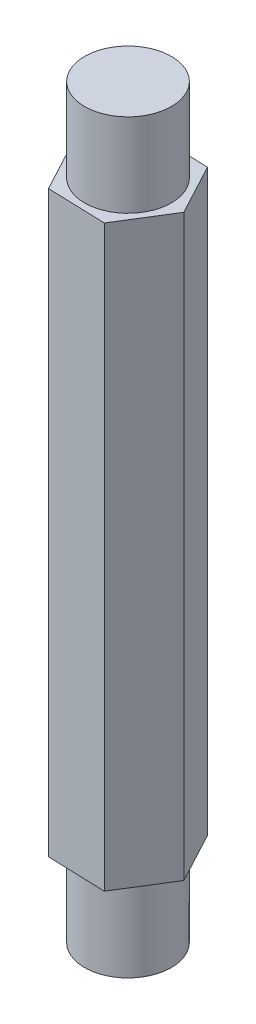
ISO-10303-21;
HEADER;
FILE_DESCRIPTION(('STEP AP214'),'2;1');
FILE_NAME('part.step','',(''),(''),'','','');
FILE_SCHEMA(('AUTOMOTIVE_DESIGN { 1 0 10303 214 1 1 1 1 }'));
ENDSEC;
DATA;
#1=APPLICATION_CONTEXT('core data for automotive mechanical design processes');
#2=APPLICATION_PROTOCOL_DEFINITION('international standard','automotive_design',2000,#1);
#3=PRODUCT_CONTEXT('',#1,'mechanical');
#4=PRODUCT('Part','Part','',(#3));
#5=PRODUCT_RELATED_PRODUCT_CATEGORY('part','',(#4));
#6=PRODUCT_DEFINITION_FORMATION('','',#4);
#7=PRODUCT_DEFINITION_CONTEXT('part definition',#1,'design');
#8=PRODUCT_DEFINITION('design','',#6,#7);
#9=PRODUCT_DEFINITION_SHAPE('','',#8);
#10=(LENGTH_UNIT() NAMED_UNIT(*) SI_UNIT(.MILLI.,.METRE.));
#11=(NAMED_UNIT(*) PLANE_ANGLE_UNIT() SI_UNIT($,.RADIAN.));
#12=(NAMED_UNIT(*) SI_UNIT($,.STERADIAN.) SOLID_ANGLE_UNIT());
#13=UNCERTAINTY_MEASURE_WITH_UNIT(LENGTH_MEASURE(1.E-05),#10,'distance_accuracy_value','');
#14=(GEOMETRIC_REPRESENTATION_CONTEXT(3) GLOBAL_UNCERTAINTY_ASSIGNED_CONTEXT((#13)) GLOBAL_UNIT_ASSIGNED_CONTEXT((#10,
#11,#12)) REPRESENTATION_CONTEXT('',''));
#15=CARTESIAN_POINT('',(0.,0.,0.));
#16=DIRECTION('',(0.,0.,1.));
#17=DIRECTION('',(1.,0.,0.));
#18=AXIS2_PLACEMENT_3D('',#15,#16,#17);
#19=CARTESIAN_POINT('',(-1.1583381975398,22.,1.86321924460156));
#20=DIRECTION('',(0.032608446753868,0.,-0.99946820319623));
#21=DIRECTION('',(-0.99946820319623,0.,-0.032608446753868));
#22=AXIS2_PLACEMENT_3D('',#19,#20,#21);
#23=PLANE('',#22);
#24=DIRECTION('',(0.99946820319623,0.,0.032608446753868));
#25=VECTOR('',#24,1.);
#26=CARTESIAN_POINT('',(-1.1583381975398,0.,1.86321924460156));
#27=LINE('',#26,#25);
#28=CARTESIAN_POINT('',(-1.1583381975398,0.,1.86321924460156));
#29=VERTEX_POINT('',#28);
#30=CARTESIAN_POINT('',(1.0344260998751,0.,1.93475992754412));
#31=VERTEX_POINT('',#30);
#32=EDGE_CURVE('E120',#29,#31,#27,.T.);
#33=ORIENTED_EDGE('',*,*,#32,.T.);
#34=DIRECTION('',(0.,-1.,0.));
#35=VECTOR('',#34,1.);
#36=CARTESIAN_POINT('',(1.0344260998751,22.,1.93475992754412));
#37=LINE('',#36,#35);
#38=CARTESIAN_POINT('',(1.0344260998751,22.,1.93475992754412));
#39=VERTEX_POINT('',#38);
#40=EDGE_CURVE('E36',#39,#31,#37,.T.);
#41=ORIENTED_EDGE('',*,*,#40,.F.);
#42=DIRECTION('',(0.99946820319623,0.,0.032608446753868));
#43=VECTOR('',#42,1.);
#44=CARTESIAN_POINT('',(-1.1583381975398,22.,1.86321924460156));
#45=LINE('',#44,#43);
#46=CARTESIAN_POINT('',(-1.1583381975398,22.,1.86321924460156));
#47=VERTEX_POINT('',#46);
#48=EDGE_CURVE('E131',#47,#39,#45,.T.);
#49=ORIENTED_EDGE('',*,*,#48,.F.);
#50=DIRECTION('',(0.,-1.,0.));
#51=VECTOR('',#50,1.);
#52=CARTESIAN_POINT('',(-1.1583381975398,22.,1.86321924460156));
#53=LINE('',#52,#51);
#54=EDGE_CURVE('E116',#47,#29,#53,.T.);
#55=ORIENTED_EDGE('',*,*,#54,.T.);
#56=EDGE_LOOP('',(#33,#41,#49,#55));
#57=FACE_BOUND('',#56,.T.);
#58=ADVANCED_FACE('F33',(#57),#23,.F.);
#59=CARTESIAN_POINT('',(1.0344260998751,22.,1.93475992754412));
#60=DIRECTION('',(-0.849260630865788,0.,-0.527973844864917));
#61=DIRECTION('',(-0.527973844864917,0.,0.849260630865788));
#62=AXIS2_PLACEMENT_3D('',#59,#60,#61);
#63=PLANE('',#62);
#64=DIRECTION('',(0.527973844864917,0.,-0.849260630865788));
#65=VECTOR('',#64,1.);
#66=CARTESIAN_POINT('',(1.0344260998751,0.,1.93475992754412));
#67=LINE('',#66,#65);
#68=CARTESIAN_POINT('',(2.1927642974149,0.,0.0715406829425664));
#69=VERTEX_POINT('',#68);
#70=EDGE_CURVE('E123',#31,#69,#67,.T.);
#71=ORIENTED_EDGE('',*,*,#70,.T.);
#72=DIRECTION('',(0.,-1.,0.));
#73=VECTOR('',#72,1.);
#74=CARTESIAN_POINT('',(2.1927642974149,22.,0.0715406829425664));
#75=LINE('',#74,#73);
#76=CARTESIAN_POINT('',(2.1927642974149,22.,0.0715406829425664));
#77=VERTEX_POINT('',#76);
#78=EDGE_CURVE('E134',#77,#69,#75,.T.);
#79=ORIENTED_EDGE('',*,*,#78,.F.);
#80=DIRECTION('',(0.527973844864917,0.,-0.849260630865788));
#81=VECTOR('',#80,1.);
#82=CARTESIAN_POINT('',(1.0344260998751,22.,1.93475992754412));
#83=LINE('',#82,#81);
#84=EDGE_CURVE('E89',#39,#77,#83,.T.);
#85=ORIENTED_EDGE('',*,*,#84,.F.);
#86=ORIENTED_EDGE('',*,*,#40,.T.);
#87=EDGE_LOOP('',(#71,#79,#85,#86));
#88=FACE_BOUND('',#87,.T.);
#89=ADVANCED_FACE('F147',(#88),#63,.F.);
#90=CARTESIAN_POINT('',(2.1927642974149,22.,0.0715406829425664));
#91=DIRECTION('',(-0.881869077619656,0.,0.471494358331313));
#92=DIRECTION('',(0.471494358331313,0.,0.881869077619656));
#93=AXIS2_PLACEMENT_3D('',#90,#91,#92);
#94=PLANE('',#93);
#95=DIRECTION('',(-0.471494358331313,0.,-0.881869077619656));
#96=VECTOR('',#95,1.);
#97=CARTESIAN_POINT('',(2.1927642974149,0.,0.0715406829425664));
#98=LINE('',#97,#96);
#99=CARTESIAN_POINT('',(1.1583381975398,0.,-1.86321924460155));
#100=VERTEX_POINT('',#99);
#101=EDGE_CURVE('E126',#69,#100,#98,.T.);
#102=ORIENTED_EDGE('',*,*,#101,.T.);
#103=DIRECTION('',(0.,-1.,0.));
#104=VECTOR('',#103,1.);
#105=CARTESIAN_POINT('',(1.1583381975398,22.,-1.86321924460155));
#106=LINE('',#105,#104);
#107=CARTESIAN_POINT('',(1.1583381975398,22.,-1.86321924460155));
#108=VERTEX_POINT('',#107);
#109=EDGE_CURVE('E111',#108,#100,#106,.T.);
#110=ORIENTED_EDGE('',*,*,#109,.F.);
#111=DIRECTION('',(-0.471494358331313,0.,-0.881869077619656));
#112=VECTOR('',#111,1.);
#113=CARTESIAN_POINT('',(2.1927642974149,22.,0.0715406829425664));
#114=LINE('',#113,#112);
#115=EDGE_CURVE('E102',#77,#108,#114,.T.);
#116=ORIENTED_EDGE('',*,*,#115,.F.);
#117=ORIENTED_EDGE('',*,*,#78,.T.);
#118=EDGE_LOOP('',(#102,#110,#116,#117));
#119=FACE_BOUND('',#118,.T.);
#120=ADVANCED_FACE('F148',(#119),#94,.F.);
#121=CARTESIAN_POINT('',(1.1583381975398,22.,-1.86321924460155));
#122=DIRECTION('',(-0.032608446753868,0.,0.99946820319623));
#123=DIRECTION('',(0.99946820319623,0.,0.032608446753868));
#124=AXIS2_PLACEMENT_3D('',#121,#122,#123);
#125=PLANE('',#124);
#126=DIRECTION('',(-0.99946820319623,0.,-0.032608446753868));
#127=VECTOR('',#126,1.);
#128=CARTESIAN_POINT('',(1.1583381975398,0.,-1.86321924460155));
#129=LINE('',#128,#127);
#130=CARTESIAN_POINT('',(-1.0344260998751,0.,-1.93475992754412));
#131=VERTEX_POINT('',#130);
#132=EDGE_CURVE('E110',#100,#131,#129,.T.);
#133=ORIENTED_EDGE('',*,*,#132,.T.);
#134=DIRECTION('',(0.,-1.,0.));
#135=VECTOR('',#134,1.);
#136=CARTESIAN_POINT('',(-1.0344260998751,22.,-1.93475992754412));
#137=LINE('',#136,#135);
#138=CARTESIAN_POINT('',(-1.0344260998751,22.,-1.93475992754412));
#139=VERTEX_POINT('',#138);
#140=EDGE_CURVE('E107',#139,#131,#137,.T.);
#141=ORIENTED_EDGE('',*,*,#140,.F.);
#142=DIRECTION('',(-0.99946820319623,0.,-0.032608446753868));
#143=VECTOR('',#142,1.);
#144=CARTESIAN_POINT('',(1.1583381975398,22.,-1.86321924460155));
#145=LINE('',#144,#143);
#146=EDGE_CURVE('E96',#108,#139,#145,.T.);
#147=ORIENTED_EDGE('',*,*,#146,.F.);
#148=ORIENTED_EDGE('',*,*,#109,.T.);
#149=EDGE_LOOP('',(#133,#141,#147,#148));
#150=FACE_BOUND('',#149,.T.);
#151=ADVANCED_FACE('F108',(#150),#125,.F.);
#152=CARTESIAN_POINT('',(-1.0344260998751,22.,-1.93475992754412));
#153=DIRECTION('',(0.849260630865788,0.,0.527973844864917));
#154=DIRECTION('',(0.527973844864917,0.,-0.849260630865788));
#155=AXIS2_PLACEMENT_3D('',#152,#153,#154);
#156=PLANE('',#155);
#157=DIRECTION('',(-0.527973844864917,0.,0.849260630865788));
#158=VECTOR('',#157,1.);
#159=CARTESIAN_POINT('',(-1.0344260998751,0.,-1.93475992754412));
#160=LINE('',#159,#158);
#161=CARTESIAN_POINT('',(-2.1927642974149,0.,-0.0715406829425681));
#162=VERTEX_POINT('',#161);
#163=EDGE_CURVE('E74',#131,#162,#160,.T.);
#164=ORIENTED_EDGE('',*,*,#163,.T.);
#165=DIRECTION('',(0.,-1.,0.));
#166=VECTOR('',#165,1.);
#167=CARTESIAN_POINT('',(-2.1927642974149,22.,-0.0715406829425681));
#168=LINE('',#167,#166);
#169=CARTESIAN_POINT('',(-2.1927642974149,22.,-0.0715406829425681));
#170=VERTEX_POINT('',#169);
#171=EDGE_CURVE('E112',#170,#162,#168,.T.);
#172=ORIENTED_EDGE('',*,*,#171,.F.);
#173=DIRECTION('',(-0.527973844864917,0.,0.849260630865788));
#174=VECTOR('',#173,1.);
#175=CARTESIAN_POINT('',(-1.0344260998751,22.,-1.93475992754412));
#176=LINE('',#175,#174);
#177=EDGE_CURVE('E100',#139,#170,#176,.T.);
#178=ORIENTED_EDGE('',*,*,#177,.F.);
#179=ORIENTED_EDGE('',*,*,#140,.T.);
#180=EDGE_LOOP('',(#164,#172,#178,#179));
#181=FACE_BOUND('',#180,.T.);
#182=ADVANCED_FACE('F114',(#181),#156,.F.);
#183=CARTESIAN_POINT('',(-2.1927642974149,22.,-0.0715406829425681));
#184=DIRECTION('',(0.881869077619656,0.,-0.471494358331313));
#185=DIRECTION('',(-0.471494358331313,0.,-0.881869077619656));
#186=AXIS2_PLACEMENT_3D('',#183,#184,#185);
#187=PLANE('',#186);
#188=DIRECTION('',(0.471494358331313,0.,0.881869077619656));
#189=VECTOR('',#188,1.);
#190=CARTESIAN_POINT('',(-2.1927642974149,0.,-0.0715406829425681));
#191=LINE('',#190,#189);
#192=EDGE_CURVE('E80',#162,#29,#191,.T.);
#193=ORIENTED_EDGE('',*,*,#192,.T.);
#194=ORIENTED_EDGE('',*,*,#54,.F.);
#195=DIRECTION('',(0.471494358331313,0.,0.881869077619656));
#196=VECTOR('',#195,1.);
#197=CARTESIAN_POINT('',(-2.1927642974149,22.,-0.0715406829425681));
#198=LINE('',#197,#196);
#199=EDGE_CURVE('E51',#170,#47,#198,.T.);
#200=ORIENTED_EDGE('',*,*,#199,.F.);
#201=ORIENTED_EDGE('',*,*,#171,.T.);
#202=EDGE_LOOP('',(#193,#194,#200,#201));
#203=FACE_BOUND('',#202,.T.);
#204=ADVANCED_FACE('F153',(#203),#187,.F.);
#205=CARTESIAN_POINT('',(0.,22.,0.));
#206=DIRECTION('',(0.,1.,0.));
#207=DIRECTION('',(0.,0.,1.));
#208=AXIS2_PLACEMENT_3D('',#205,#206,#207);
#209=PLANE('',#208);
#210=CARTESIAN_POINT('',(0.,22.,0.));
#211=DIRECTION('',(0.,1.,0.));
#212=DIRECTION('',(0.,0.,1.));
#213=AXIS2_PLACEMENT_3D('',#210,#211,#212);
#214=CIRCLE('',#213,1.65);
#215=CARTESIAN_POINT('',(0.,22.,1.65));
#216=VERTEX_POINT('',#215);
#217=EDGE_CURVE('E42',#216,#216,#214,.T.);
#218=ORIENTED_EDGE('',*,*,#217,.F.);
#219=EDGE_LOOP('',(#218));
#220=FACE_BOUND('',#219,.T.);
#221=ORIENTED_EDGE('',*,*,#48,.T.);
#222=ORIENTED_EDGE('',*,*,#84,.T.);
#223=ORIENTED_EDGE('',*,*,#115,.T.);
#224=ORIENTED_EDGE('',*,*,#146,.T.);
#225=ORIENTED_EDGE('',*,*,#177,.T.);
#226=ORIENTED_EDGE('',*,*,#199,.T.);
#227=EDGE_LOOP('',(#221,#222,#223,#224,#225,#226));
#228=FACE_BOUND('',#227,.T.);
#229=ADVANCED_FACE('F98',(#220,#228),#209,.T.);
#230=CARTESIAN_POINT('',(0.,0.,0.));
#231=DIRECTION('',(0.,1.,0.));
#232=DIRECTION('',(0.,0.,1.));
#233=AXIS2_PLACEMENT_3D('',#230,#231,#232);
#234=PLANE('',#233);
#235=CARTESIAN_POINT('',(0.,0.,0.));
#236=DIRECTION('',(0.,-1.,0.));
#237=DIRECTION('',(0.,0.,-1.));
#238=AXIS2_PLACEMENT_3D('',#235,#236,#237);
#239=CIRCLE('',#238,1.65);
#240=CARTESIAN_POINT('',(0.,0.,-1.65));
#241=VERTEX_POINT('',#240);
#242=EDGE_CURVE('E11',#241,#241,#239,.T.);
#243=ORIENTED_EDGE('',*,*,#242,.F.);
#244=EDGE_LOOP('',(#243));
#245=FACE_BOUND('',#244,.T.);
#246=ORIENTED_EDGE('',*,*,#32,.F.);
#247=ORIENTED_EDGE('',*,*,#192,.F.);
#248=ORIENTED_EDGE('',*,*,#163,.F.);
#249=ORIENTED_EDGE('',*,*,#132,.F.);
#250=ORIENTED_EDGE('',*,*,#101,.F.);
#251=ORIENTED_EDGE('',*,*,#70,.F.);
#252=EDGE_LOOP('',(#246,#247,#248,#249,#250,#251));
#253=FACE_BOUND('',#252,.T.);
#254=ADVANCED_FACE('F151',(#245,#253),#234,.F.);
#255=CARTESIAN_POINT('',(0.,25.175,0.));
#256=DIRECTION('',(0.,-1.,0.));
#257=DIRECTION('',(0.,0.,-1.));
#258=AXIS2_PLACEMENT_3D('',#255,#256,#257);
#259=CYLINDRICAL_SURFACE('',#258,1.65);
#260=CARTESIAN_POINT('',(0.,25.175,0.));
#261=DIRECTION('',(0.,1.,0.));
#262=DIRECTION('',(0.,0.,1.));
#263=AXIS2_PLACEMENT_3D('',#260,#261,#262);
#264=CIRCLE('',#263,1.65);
#265=CARTESIAN_POINT('',(0.,25.175,1.65));
#266=VERTEX_POINT('',#265);
#267=EDGE_CURVE('E124',#266,#266,#264,.T.);
#268=ORIENTED_EDGE('',*,*,#267,.F.);
#269=EDGE_LOOP('',(#268));
#270=FACE_BOUND('',#269,.T.);
#271=ORIENTED_EDGE('',*,*,#217,.T.);
#272=EDGE_LOOP('',(#271));
#273=FACE_BOUND('',#272,.T.);
#274=ADVANCED_FACE('F199',(#270,#273),#259,.T.);
#275=CARTESIAN_POINT('',(0.,25.175,0.));
#276=DIRECTION('',(0.,1.,0.));
#277=DIRECTION('',(0.,0.,1.));
#278=AXIS2_PLACEMENT_3D('',#275,#276,#277);
#279=PLANE('',#278);
#280=ORIENTED_EDGE('',*,*,#267,.T.);
#281=EDGE_LOOP('',(#280));
#282=FACE_BOUND('',#281,.T.);
#283=ADVANCED_FACE('F204',(#282),#279,.T.);
#284=CARTESIAN_POINT('',(0.,-3.175,0.));
#285=DIRECTION('',(0.,1.,0.));
#286=DIRECTION('',(0.,0.,1.));
#287=AXIS2_PLACEMENT_3D('',#284,#285,#286);
#288=CYLINDRICAL_SURFACE('',#287,1.65);
#289=CARTESIAN_POINT('',(0.,-3.175,0.));
#290=DIRECTION('',(0.,-1.,0.));
#291=DIRECTION('',(0.,0.,-1.));
#292=AXIS2_PLACEMENT_3D('',#289,#290,#291);
#293=CIRCLE('',#292,1.65);
#294=CARTESIAN_POINT('',(0.,-3.175,-1.65));
#295=VERTEX_POINT('',#294);
#296=EDGE_CURVE('E246',#295,#295,#293,.T.);
#297=ORIENTED_EDGE('',*,*,#296,.F.);
#298=EDGE_LOOP('',(#297));
#299=FACE_BOUND('',#298,.T.);
#300=ORIENTED_EDGE('',*,*,#242,.T.);
#301=EDGE_LOOP('',(#300));
#302=FACE_BOUND('',#301,.T.);
#303=ADVANCED_FACE('F214',(#299,#302),#288,.T.);
#304=CARTESIAN_POINT('',(0.,-3.175,0.));
#305=DIRECTION('',(0.,-1.,0.));
#306=DIRECTION('',(0.,0.,-1.));
#307=AXIS2_PLACEMENT_3D('',#304,#305,#306);
#308=PLANE('',#307);
#309=ORIENTED_EDGE('',*,*,#296,.T.);
#310=EDGE_LOOP('',(#309));
#311=FACE_BOUND('',#310,.T.);
#312=ADVANCED_FACE('F230',(#311),#308,.T.);
#313=CLOSED_SHELL('',(#58,#89,#120,#151,#182,#204,#229,#254,#274,#283,#303,#312));
#314=MANIFOLD_SOLID_BREP('B2',#313);
#315=ADVANCED_BREP_SHAPE_REPRESENTATION('',(#18,#314),#14);
#316=SHAPE_DEFINITION_REPRESENTATION(#9,#315);
ENDSEC;
END-ISO-10303-21;
